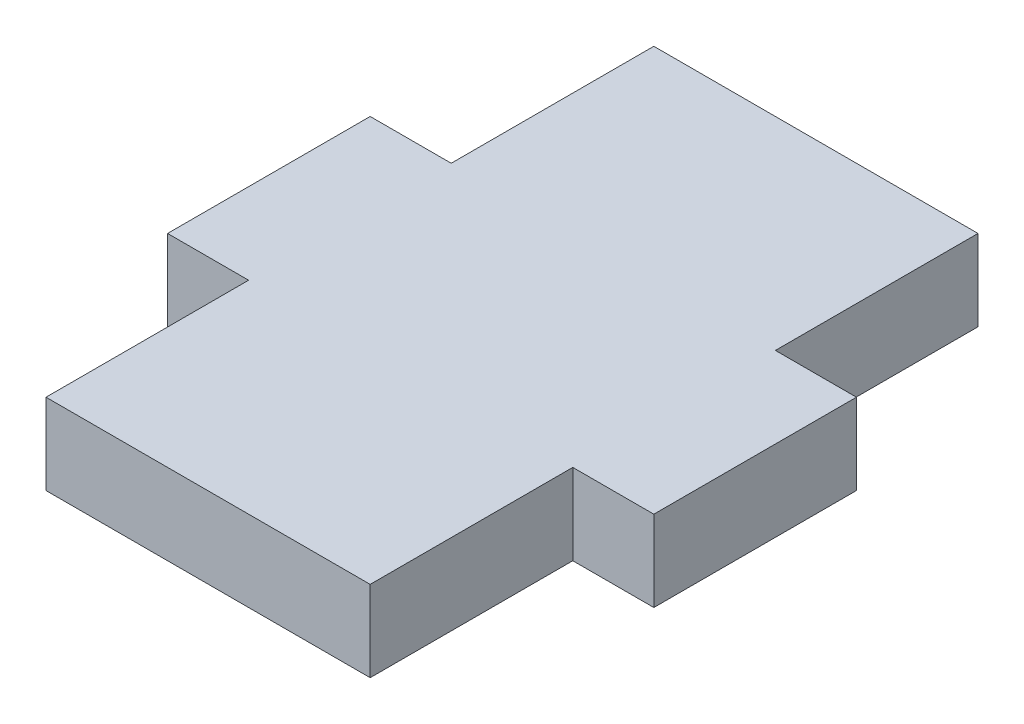
ISO-10303-21;
HEADER;
FILE_DESCRIPTION(('STEP AP214'),'2;1');
FILE_NAME('part.step','',(''),(''),'','','');
FILE_SCHEMA(('AUTOMOTIVE_DESIGN { 1 0 10303 214 1 1 1 1 }'));
ENDSEC;
DATA;
#1=APPLICATION_CONTEXT('core data for automotive mechanical design processes');
#2=APPLICATION_PROTOCOL_DEFINITION('international standard','automotive_design',2000,#1);
#3=PRODUCT_CONTEXT('',#1,'mechanical');
#4=PRODUCT('Part','Part','',(#3));
#5=PRODUCT_RELATED_PRODUCT_CATEGORY('part','',(#4));
#6=PRODUCT_DEFINITION_FORMATION('','',#4);
#7=PRODUCT_DEFINITION_CONTEXT('part definition',#1,'design');
#8=PRODUCT_DEFINITION('design','',#6,#7);
#9=PRODUCT_DEFINITION_SHAPE('','',#8);
#10=(LENGTH_UNIT() NAMED_UNIT(*) SI_UNIT(.MILLI.,.METRE.));
#11=(NAMED_UNIT(*) PLANE_ANGLE_UNIT() SI_UNIT($,.RADIAN.));
#12=(NAMED_UNIT(*) SI_UNIT($,.STERADIAN.) SOLID_ANGLE_UNIT());
#13=UNCERTAINTY_MEASURE_WITH_UNIT(LENGTH_MEASURE(1.E-05),#10,'distance_accuracy_value','');
#14=(GEOMETRIC_REPRESENTATION_CONTEXT(3) GLOBAL_UNCERTAINTY_ASSIGNED_CONTEXT((#13)) GLOBAL_UNIT_ASSIGNED_CONTEXT((#10,
#11,#12)) REPRESENTATION_CONTEXT('',''));
#15=CARTESIAN_POINT('',(0.,0.,0.));
#16=DIRECTION('',(0.,0.,1.));
#17=DIRECTION('',(1.,0.,0.));
#18=AXIS2_PLACEMENT_3D('',#15,#16,#17);
#19=CARTESIAN_POINT('',(0.,-373.324775164043,-15.));
#20=DIRECTION('',(-1.,0.,0.));
#21=DIRECTION('',(0.,-1.,0.));
#22=AXIS2_PLACEMENT_3D('',#19,#20,#21);
#23=PLANE('',#22);
#24=DIRECTION('',(0.,1.,0.));
#25=VECTOR('',#24,1.);
#26=CARTESIAN_POINT('',(-5.70286431320361E-12,-375.320100819107,-10.));
#27=LINE('',#26,#25);
#28=CARTESIAN_POINT('',(0.,-375.320100819107,-10.));
#29=VERTEX_POINT('',#28);
#30=CARTESIAN_POINT('',(-5.67254600238933E-12,-373.324775164043,-10.));
#31=VERTEX_POINT('',#30);
#32=EDGE_CURVE('E239',#29,#31,#27,.T.);
#33=ORIENTED_EDGE('',*,*,#32,.F.);
#34=DIRECTION('',(0.,0.,1.));
#35=VECTOR('',#34,1.);
#36=CARTESIAN_POINT('',(0.,-375.320100819107,-15.));
#37=LINE('',#36,#35);
#38=CARTESIAN_POINT('',(0.,-375.320100819107,-15.));
#39=VERTEX_POINT('',#38);
#40=EDGE_CURVE('E150',#39,#29,#37,.T.);
#41=ORIENTED_EDGE('',*,*,#40,.F.);
#42=DIRECTION('',(0.,-1.,0.));
#43=VECTOR('',#42,1.);
#44=CARTESIAN_POINT('',(0.,-373.324775164043,-15.));
#45=LINE('',#44,#43);
#46=CARTESIAN_POINT('',(0.,-373.324775164043,-15.));
#47=VERTEX_POINT('',#46);
#48=EDGE_CURVE('E190',#47,#39,#45,.T.);
#49=ORIENTED_EDGE('',*,*,#48,.F.);
#50=DIRECTION('',(0.,0.,1.));
#51=VECTOR('',#50,1.);
#52=CARTESIAN_POINT('',(0.,-373.324775164043,-15.));
#53=LINE('',#52,#51);
#54=EDGE_CURVE('E205',#47,#31,#53,.T.);
#55=ORIENTED_EDGE('',*,*,#54,.T.);
#56=EDGE_LOOP('',(#33,#41,#49,#55));
#57=FACE_BOUND('',#56,.T.);
#58=ADVANCED_FACE('F34',(#57),#23,.F.);
#59=CARTESIAN_POINT('',(-7.99999999999997,-373.324775164043,-15.));
#60=DIRECTION('',(-1.,0.,0.));
#61=DIRECTION('',(0.,0.,1.));
#62=AXIS2_PLACEMENT_3D('',#59,#60,#61);
#63=PLANE('',#62);
#64=DIRECTION('',(0.,-1.,0.));
#65=VECTOR('',#64,1.);
#66=CARTESIAN_POINT('',(-7.99999999999997,-375.320100819107,-10.));
#67=LINE('',#66,#65);
#68=CARTESIAN_POINT('',(-7.99999999999997,-373.324775164043,-10.));
#69=VERTEX_POINT('',#68);
#70=CARTESIAN_POINT('',(-7.99999999999997,-375.320100819107,-10.));
#71=VERTEX_POINT('',#70);
#72=EDGE_CURVE('E151',#69,#71,#67,.T.);
#73=ORIENTED_EDGE('',*,*,#72,.F.);
#74=DIRECTION('',(0.,0.,1.));
#75=VECTOR('',#74,1.);
#76=CARTESIAN_POINT('',(-7.99999999999997,-373.324775164043,-15.));
#77=LINE('',#76,#75);
#78=CARTESIAN_POINT('',(-7.99999999999997,-373.324775164043,-15.));
#79=VERTEX_POINT('',#78);
#80=EDGE_CURVE('E11',#79,#69,#77,.T.);
#81=ORIENTED_EDGE('',*,*,#80,.F.);
#82=DIRECTION('',(0.,-1.,0.));
#83=VECTOR('',#82,1.);
#84=CARTESIAN_POINT('',(-7.99999999999997,-373.324775164043,-15.));
#85=LINE('',#84,#83);
#86=CARTESIAN_POINT('',(-7.99999999999997,-375.320100819107,-15.));
#87=VERTEX_POINT('',#86);
#88=EDGE_CURVE('E184',#79,#87,#85,.T.);
#89=ORIENTED_EDGE('',*,*,#88,.T.);
#90=DIRECTION('',(0.,0.,1.));
#91=VECTOR('',#90,1.);
#92=CARTESIAN_POINT('',(-7.99999999999997,-375.320100819107,-15.));
#93=LINE('',#92,#91);
#94=EDGE_CURVE('E38',#87,#71,#93,.T.);
#95=ORIENTED_EDGE('',*,*,#94,.T.);
#96=EDGE_LOOP('',(#73,#81,#89,#95));
#97=FACE_BOUND('',#96,.T.);
#98=ADVANCED_FACE('F231',(#97),#63,.T.);
#99=DIRECTION('',(0.,1.,0.));
#100=VECTOR('',#99,1.);
#101=CARTESIAN_POINT('',(-7.99999999999997,-375.320100819107,-5.));
#102=LINE('',#101,#100);
#103=CARTESIAN_POINT('',(-7.99999999999997,-375.320100819107,-5.));
#104=VERTEX_POINT('',#103);
#105=CARTESIAN_POINT('',(-7.99999999999997,-373.324775164043,-5.));
#106=VERTEX_POINT('',#105);
#107=EDGE_CURVE('E154',#104,#106,#102,.T.);
#108=ORIENTED_EDGE('',*,*,#107,.F.);
#109=CARTESIAN_POINT('',(-7.99999999999997,-375.320100819107,0.));
#110=VERTEX_POINT('',#109);
#111=EDGE_CURVE('E195',#104,#110,#93,.T.);
#112=ORIENTED_EDGE('',*,*,#111,.T.);
#113=DIRECTION('',(0.,-1.,0.));
#114=VECTOR('',#113,1.);
#115=CARTESIAN_POINT('',(-7.99999999999997,-373.324775164043,0.));
#116=LINE('',#115,#114);
#117=CARTESIAN_POINT('',(-7.99999999999997,-373.324775164043,0.));
#118=VERTEX_POINT('',#117);
#119=EDGE_CURVE('E183',#118,#110,#116,.T.);
#120=ORIENTED_EDGE('',*,*,#119,.F.);
#121=EDGE_CURVE('E43',#106,#118,#77,.T.);
#122=ORIENTED_EDGE('',*,*,#121,.F.);
#123=EDGE_LOOP('',(#108,#112,#120,#122));
#124=FACE_BOUND('',#123,.T.);
#125=ADVANCED_FACE('F36',(#124),#63,.T.);
#126=CARTESIAN_POINT('',(0.,-373.324775164043,-15.));
#127=DIRECTION('',(0.,1.,0.));
#128=DIRECTION('',(0.,0.,1.));
#129=AXIS2_PLACEMENT_3D('',#126,#127,#128);
#130=PLANE('',#129);
#131=DIRECTION('',(-1.,0.,0.));
#132=VECTOR('',#131,1.);
#133=CARTESIAN_POINT('',(0.,-373.324775164043,0.));
#134=LINE('',#133,#132);
#135=CARTESIAN_POINT('',(0.,-373.324775164043,0.));
#136=VERTEX_POINT('',#135);
#137=EDGE_CURVE('E188',#136,#118,#134,.T.);
#138=ORIENTED_EDGE('',*,*,#137,.F.);
#139=CARTESIAN_POINT('',(0.,-373.324775164043,-5.));
#140=VERTEX_POINT('',#139);
#141=EDGE_CURVE('E206',#140,#136,#53,.T.);
#142=ORIENTED_EDGE('',*,*,#141,.F.);
#143=DIRECTION('',(-1.,0.,0.));
#144=VECTOR('',#143,1.);
#145=CARTESIAN_POINT('',(1.99999999999433,-373.324775164043,-5.));
#146=LINE('',#145,#144);
#147=CARTESIAN_POINT('',(1.99999999999433,-373.324775164043,-5.));
#148=VERTEX_POINT('',#147);
#149=EDGE_CURVE('E156',#148,#140,#146,.T.);
#150=ORIENTED_EDGE('',*,*,#149,.F.);
#151=DIRECTION('',(0.,0.,-1.));
#152=VECTOR('',#151,1.);
#153=CARTESIAN_POINT('',(1.99999999999433,-373.324775164043,-5.));
#154=LINE('',#153,#152);
#155=CARTESIAN_POINT('',(1.99999999999433,-373.324775164043,-10.));
#156=VERTEX_POINT('',#155);
#157=EDGE_CURVE('E135',#148,#156,#154,.T.);
#158=ORIENTED_EDGE('',*,*,#157,.T.);
#159=DIRECTION('',(-1.,0.,0.));
#160=VECTOR('',#159,1.);
#161=CARTESIAN_POINT('',(1.99999999999433,-373.324775164043,-10.));
#162=LINE('',#161,#160);
#163=EDGE_CURVE('E131',#156,#31,#162,.T.);
#164=ORIENTED_EDGE('',*,*,#163,.T.);
#165=ORIENTED_EDGE('',*,*,#54,.F.);
#166=DIRECTION('',(-1.,0.,0.));
#167=VECTOR('',#166,1.);
#168=CARTESIAN_POINT('',(0.,-373.324775164043,-15.));
#169=LINE('',#168,#167);
#170=EDGE_CURVE('E192',#47,#79,#169,.T.);
#171=ORIENTED_EDGE('',*,*,#170,.T.);
#172=ORIENTED_EDGE('',*,*,#80,.T.);
#173=DIRECTION('',(1.,0.,0.));
#174=VECTOR('',#173,1.);
#175=CARTESIAN_POINT('',(-9.99999999999997,-373.324775164043,-10.));
#176=LINE('',#175,#174);
#177=CARTESIAN_POINT('',(-9.99999999999997,-373.324775164043,-10.));
#178=VERTEX_POINT('',#177);
#179=EDGE_CURVE('E168',#178,#69,#176,.T.);
#180=ORIENTED_EDGE('',*,*,#179,.F.);
#181=DIRECTION('',(0.,0.,-1.));
#182=VECTOR('',#181,1.);
#183=CARTESIAN_POINT('',(-9.99999999999997,-373.324775164043,-10.));
#184=LINE('',#183,#182);
#185=CARTESIAN_POINT('',(-9.99999999999997,-373.324775164043,-5.));
#186=VERTEX_POINT('',#185);
#187=EDGE_CURVE('E167',#186,#178,#184,.T.);
#188=ORIENTED_EDGE('',*,*,#187,.F.);
#189=DIRECTION('',(1.,0.,0.));
#190=VECTOR('',#189,1.);
#191=CARTESIAN_POINT('',(-9.99999999999997,-373.324775164043,-5.));
#192=LINE('',#191,#190);
#193=EDGE_CURVE('E174',#186,#106,#192,.T.);
#194=ORIENTED_EDGE('',*,*,#193,.T.);
#195=ORIENTED_EDGE('',*,*,#121,.T.);
#196=EDGE_LOOP('',(#138,#142,#150,#158,#164,#165,#171,#172,#180,#188,#194,#195));
#197=FACE_BOUND('',#196,.T.);
#198=ADVANCED_FACE('F217',(#197),#130,.T.);
#199=CARTESIAN_POINT('',(0.,-375.320100819107,-5.));
#200=VERTEX_POINT('',#199);
#201=CARTESIAN_POINT('',(0.,-375.320100819107,0.));
#202=VERTEX_POINT('',#201);
#203=EDGE_CURVE('E56',#200,#202,#37,.T.);
#204=ORIENTED_EDGE('',*,*,#203,.F.);
#205=DIRECTION('',(0.,1.,0.));
#206=VECTOR('',#205,1.);
#207=CARTESIAN_POINT('',(-5.70286431320361E-12,-375.320100819107,-5.));
#208=LINE('',#207,#206);
#209=EDGE_CURVE('E51',#200,#140,#208,.T.);
#210=ORIENTED_EDGE('',*,*,#209,.T.);
#211=ORIENTED_EDGE('',*,*,#141,.T.);
#212=DIRECTION('',(0.,-1.,0.));
#213=VECTOR('',#212,1.);
#214=CARTESIAN_POINT('',(0.,-373.324775164043,0.));
#215=LINE('',#214,#213);
#216=EDGE_CURVE('E201',#136,#202,#215,.T.);
#217=ORIENTED_EDGE('',*,*,#216,.T.);
#218=EDGE_LOOP('',(#204,#210,#211,#217));
#219=FACE_BOUND('',#218,.T.);
#220=ADVANCED_FACE('F258',(#219),#23,.F.);
#221=CARTESIAN_POINT('',(-7.99999999999997,-375.320100819107,-15.));
#222=DIRECTION('',(0.,-1.,0.));
#223=DIRECTION('',(0.,0.,-1.));
#224=AXIS2_PLACEMENT_3D('',#221,#222,#223);
#225=PLANE('',#224);
#226=DIRECTION('',(1.,0.,0.));
#227=VECTOR('',#226,1.);
#228=CARTESIAN_POINT('',(-7.99999999999997,-375.320100819107,0.));
#229=LINE('',#228,#227);
#230=EDGE_CURVE('E198',#110,#202,#229,.T.);
#231=ORIENTED_EDGE('',*,*,#230,.F.);
#232=ORIENTED_EDGE('',*,*,#111,.F.);
#233=DIRECTION('',(1.,0.,0.));
#234=VECTOR('',#233,1.);
#235=CARTESIAN_POINT('',(-9.99999999999997,-375.320100819107,-5.));
#236=LINE('',#235,#234);
#237=CARTESIAN_POINT('',(-9.99999999999997,-375.320100819107,-5.));
#238=VERTEX_POINT('',#237);
#239=EDGE_CURVE('E177',#238,#104,#236,.T.);
#240=ORIENTED_EDGE('',*,*,#239,.F.);
#241=DIRECTION('',(0.,0.,1.));
#242=VECTOR('',#241,1.);
#243=CARTESIAN_POINT('',(-9.99999999999997,-375.320100819107,-10.));
#244=LINE('',#243,#242);
#245=CARTESIAN_POINT('',(-9.99999999999997,-375.320100819107,-10.));
#246=VERTEX_POINT('',#245);
#247=EDGE_CURVE('E163',#246,#238,#244,.T.);
#248=ORIENTED_EDGE('',*,*,#247,.F.);
#249=DIRECTION('',(1.,0.,0.));
#250=VECTOR('',#249,1.);
#251=CARTESIAN_POINT('',(-9.99999999999997,-375.320100819107,-10.));
#252=LINE('',#251,#250);
#253=EDGE_CURVE('E180',#246,#71,#252,.T.);
#254=ORIENTED_EDGE('',*,*,#253,.T.);
#255=ORIENTED_EDGE('',*,*,#94,.F.);
#256=DIRECTION('',(1.,0.,0.));
#257=VECTOR('',#256,1.);
#258=CARTESIAN_POINT('',(-7.99999999999997,-375.320100819107,-15.));
#259=LINE('',#258,#257);
#260=EDGE_CURVE('E187',#87,#39,#259,.T.);
#261=ORIENTED_EDGE('',*,*,#260,.T.);
#262=ORIENTED_EDGE('',*,*,#40,.T.);
#263=DIRECTION('',(-1.,0.,0.));
#264=VECTOR('',#263,1.);
#265=CARTESIAN_POINT('',(1.9999999999943,-375.320100819107,-10.));
#266=LINE('',#265,#264);
#267=CARTESIAN_POINT('',(1.9999999999943,-375.320100819107,-10.));
#268=VERTEX_POINT('',#267);
#269=EDGE_CURVE('E129',#268,#29,#266,.T.);
#270=ORIENTED_EDGE('',*,*,#269,.F.);
#271=DIRECTION('',(0.,0.,-1.));
#272=VECTOR('',#271,1.);
#273=CARTESIAN_POINT('',(1.9999999999943,-375.320100819107,-5.));
#274=LINE('',#273,#272);
#275=CARTESIAN_POINT('',(1.9999999999943,-375.320100819107,-5.));
#276=VERTEX_POINT('',#275);
#277=EDGE_CURVE('E136',#276,#268,#274,.T.);
#278=ORIENTED_EDGE('',*,*,#277,.F.);
#279=DIRECTION('',(-1.,0.,0.));
#280=VECTOR('',#279,1.);
#281=CARTESIAN_POINT('',(1.9999999999943,-375.320100819107,-5.));
#282=LINE('',#281,#280);
#283=EDGE_CURVE('E245',#276,#200,#282,.T.);
#284=ORIENTED_EDGE('',*,*,#283,.T.);
#285=ORIENTED_EDGE('',*,*,#203,.T.);
#286=EDGE_LOOP('',(#231,#232,#240,#248,#254,#255,#261,#262,#270,#278,#284,#285));
#287=FACE_BOUND('',#286,.T.);
#288=ADVANCED_FACE('F147',(#287),#225,.T.);
#289=CARTESIAN_POINT('',(0.,0.,-15.));
#290=DIRECTION('',(0.,0.,1.));
#291=DIRECTION('',(1.,0.,0.));
#292=AXIS2_PLACEMENT_3D('',#289,#290,#291);
#293=PLANE('',#292);
#294=ORIENTED_EDGE('',*,*,#88,.F.);
#295=ORIENTED_EDGE('',*,*,#170,.F.);
#296=ORIENTED_EDGE('',*,*,#48,.T.);
#297=ORIENTED_EDGE('',*,*,#260,.F.);
#298=EDGE_LOOP('',(#294,#295,#296,#297));
#299=FACE_BOUND('',#298,.T.);
#300=ADVANCED_FACE('F236',(#299),#293,.F.);
#301=CARTESIAN_POINT('',(0.,0.,0.));
#302=DIRECTION('',(0.,0.,1.));
#303=DIRECTION('',(1.,0.,0.));
#304=AXIS2_PLACEMENT_3D('',#301,#302,#303);
#305=PLANE('',#304);
#306=ORIENTED_EDGE('',*,*,#119,.T.);
#307=ORIENTED_EDGE('',*,*,#230,.T.);
#308=ORIENTED_EDGE('',*,*,#216,.F.);
#309=ORIENTED_EDGE('',*,*,#137,.T.);
#310=EDGE_LOOP('',(#306,#307,#308,#309));
#311=FACE_BOUND('',#310,.T.);
#312=ADVANCED_FACE('F214',(#311),#305,.T.);
#313=CARTESIAN_POINT('',(-9.99999999999997,-375.320100819107,-10.));
#314=DIRECTION('',(0.,0.,1.));
#315=DIRECTION('',(1.,0.,0.));
#316=AXIS2_PLACEMENT_3D('',#313,#314,#315);
#317=PLANE('',#316);
#318=ORIENTED_EDGE('',*,*,#72,.T.);
#319=ORIENTED_EDGE('',*,*,#253,.F.);
#320=DIRECTION('',(0.,-1.,0.));
#321=VECTOR('',#320,1.);
#322=CARTESIAN_POINT('',(-9.99999999999997,-375.320100819107,-10.));
#323=LINE('',#322,#321);
#324=EDGE_CURVE('E160',#178,#246,#323,.T.);
#325=ORIENTED_EDGE('',*,*,#324,.F.);
#326=ORIENTED_EDGE('',*,*,#179,.T.);
#327=EDGE_LOOP('',(#318,#319,#325,#326));
#328=FACE_BOUND('',#327,.T.);
#329=ADVANCED_FACE('F230',(#328),#317,.F.);
#330=CARTESIAN_POINT('',(-9.99999999999997,-375.320100819107,-5.));
#331=DIRECTION('',(0.,0.,-1.));
#332=DIRECTION('',(-1.,0.,0.));
#333=AXIS2_PLACEMENT_3D('',#330,#331,#332);
#334=PLANE('',#333);
#335=ORIENTED_EDGE('',*,*,#107,.T.);
#336=ORIENTED_EDGE('',*,*,#193,.F.);
#337=DIRECTION('',(0.,1.,0.));
#338=VECTOR('',#337,1.);
#339=CARTESIAN_POINT('',(-9.99999999999997,-375.320100819107,-5.));
#340=LINE('',#339,#338);
#341=EDGE_CURVE('E165',#238,#186,#340,.T.);
#342=ORIENTED_EDGE('',*,*,#341,.F.);
#343=ORIENTED_EDGE('',*,*,#239,.T.);
#344=EDGE_LOOP('',(#335,#336,#342,#343));
#345=FACE_BOUND('',#344,.T.);
#346=ADVANCED_FACE('F222',(#345),#334,.F.);
#347=CARTESIAN_POINT('',(-9.99999999999997,0.,0.));
#348=DIRECTION('',(1.,0.,0.));
#349=DIRECTION('',(0.,0.,-1.));
#350=AXIS2_PLACEMENT_3D('',#347,#348,#349);
#351=PLANE('',#350);
#352=ORIENTED_EDGE('',*,*,#324,.T.);
#353=ORIENTED_EDGE('',*,*,#247,.T.);
#354=ORIENTED_EDGE('',*,*,#341,.T.);
#355=ORIENTED_EDGE('',*,*,#187,.T.);
#356=EDGE_LOOP('',(#352,#353,#354,#355));
#357=FACE_BOUND('',#356,.T.);
#358=ADVANCED_FACE('F227',(#357),#351,.F.);
#359=CARTESIAN_POINT('',(1.9999999999943,-375.320100819107,-10.));
#360=DIRECTION('',(0.,0.,1.));
#361=DIRECTION('',(1.,0.,0.));
#362=AXIS2_PLACEMENT_3D('',#359,#360,#361);
#363=PLANE('',#362);
#364=ORIENTED_EDGE('',*,*,#32,.T.);
#365=ORIENTED_EDGE('',*,*,#163,.F.);
#366=DIRECTION('',(0.,1.,0.));
#367=VECTOR('',#366,1.);
#368=CARTESIAN_POINT('',(1.9999999999943,-375.320100819107,-10.));
#369=LINE('',#368,#367);
#370=EDGE_CURVE('E124',#268,#156,#369,.T.);
#371=ORIENTED_EDGE('',*,*,#370,.F.);
#372=ORIENTED_EDGE('',*,*,#269,.T.);
#373=EDGE_LOOP('',(#364,#365,#371,#372));
#374=FACE_BOUND('',#373,.T.);
#375=ADVANCED_FACE('F127',(#374),#363,.F.);
#376=CARTESIAN_POINT('',(1.9999999999943,-375.320100819107,-5.));
#377=DIRECTION('',(0.,0.,1.));
#378=DIRECTION('',(1.,0.,0.));
#379=AXIS2_PLACEMENT_3D('',#376,#377,#378);
#380=PLANE('',#379);
#381=ORIENTED_EDGE('',*,*,#209,.F.);
#382=ORIENTED_EDGE('',*,*,#283,.F.);
#383=DIRECTION('',(0.,1.,0.));
#384=VECTOR('',#383,1.);
#385=CARTESIAN_POINT('',(1.9999999999943,-375.320100819107,-5.));
#386=LINE('',#385,#384);
#387=EDGE_CURVE('E142',#276,#148,#386,.T.);
#388=ORIENTED_EDGE('',*,*,#387,.T.);
#389=ORIENTED_EDGE('',*,*,#149,.T.);
#390=EDGE_LOOP('',(#381,#382,#388,#389));
#391=FACE_BOUND('',#390,.T.);
#392=ADVANCED_FACE('F247',(#391),#380,.T.);
#393=CARTESIAN_POINT('',(2.,0.,0.));
#394=DIRECTION('',(1.,0.,0.));
#395=DIRECTION('',(0.,1.,0.));
#396=AXIS2_PLACEMENT_3D('',#393,#394,#395);
#397=PLANE('',#396);
#398=ORIENTED_EDGE('',*,*,#277,.T.);
#399=ORIENTED_EDGE('',*,*,#370,.T.);
#400=ORIENTED_EDGE('',*,*,#157,.F.);
#401=ORIENTED_EDGE('',*,*,#387,.F.);
#402=EDGE_LOOP('',(#398,#399,#400,#401));
#403=FACE_BOUND('',#402,.T.);
#404=ADVANCED_FACE('F140',(#403),#397,.T.);
#405=CLOSED_SHELL('',(#58,#98,#125,#198,#220,#288,#300,#312,#329,#346,#358,#375,#392,#404));
#406=MANIFOLD_SOLID_BREP('B2',#405);
#407=ADVANCED_BREP_SHAPE_REPRESENTATION('',(#18,#406),#14);
#408=SHAPE_DEFINITION_REPRESENTATION(#9,#407);
ENDSEC;
END-ISO-10303-21;
